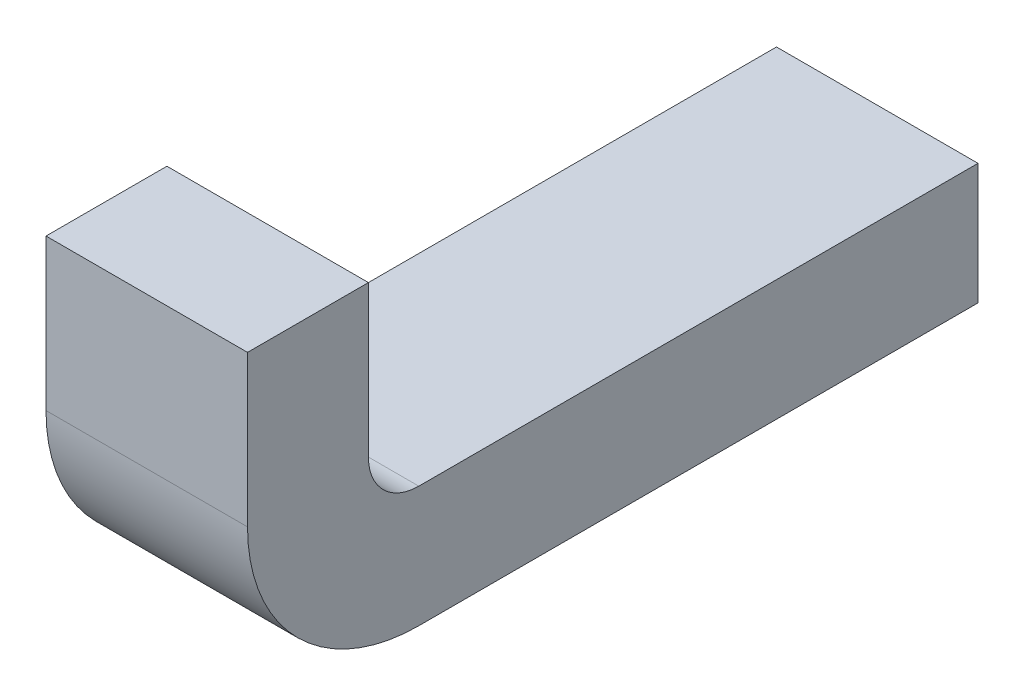
ISO-10303-21;
HEADER;
FILE_DESCRIPTION(('STEP AP214'),'2;1');
FILE_NAME('part.step','',(''),(''),'','','');
FILE_SCHEMA(('AUTOMOTIVE_DESIGN { 1 0 10303 214 1 1 1 1 }'));
ENDSEC;
DATA;
#1=APPLICATION_CONTEXT('core data for automotive mechanical design processes');
#2=APPLICATION_PROTOCOL_DEFINITION('international standard','automotive_design',2000,#1);
#3=PRODUCT_CONTEXT('',#1,'mechanical');
#4=PRODUCT('Part','Part','',(#3));
#5=PRODUCT_RELATED_PRODUCT_CATEGORY('part','',(#4));
#6=PRODUCT_DEFINITION_FORMATION('','',#4);
#7=PRODUCT_DEFINITION_CONTEXT('part definition',#1,'design');
#8=PRODUCT_DEFINITION('design','',#6,#7);
#9=PRODUCT_DEFINITION_SHAPE('','',#8);
#10=(LENGTH_UNIT() NAMED_UNIT(*) SI_UNIT(.MILLI.,.METRE.));
#11=(NAMED_UNIT(*) PLANE_ANGLE_UNIT() SI_UNIT($,.RADIAN.));
#12=(NAMED_UNIT(*) SI_UNIT($,.STERADIAN.) SOLID_ANGLE_UNIT());
#13=UNCERTAINTY_MEASURE_WITH_UNIT(LENGTH_MEASURE(1.E-05),#10,'distance_accuracy_value','');
#14=(GEOMETRIC_REPRESENTATION_CONTEXT(3) GLOBAL_UNCERTAINTY_ASSIGNED_CONTEXT((#13)) GLOBAL_UNIT_ASSIGNED_CONTEXT((#10,
#11,#12)) REPRESENTATION_CONTEXT('',''));
#15=CARTESIAN_POINT('',(0.,0.,0.));
#16=DIRECTION('',(0.,0.,1.));
#17=DIRECTION('',(1.,0.,0.));
#18=AXIS2_PLACEMENT_3D('',#15,#16,#17);
#19=CARTESIAN_POINT('',(-1.35,0.,-3.300000000002));
#20=DIRECTION('',(0.,-1.,0.));
#21=DIRECTION('',(1.,0.,0.));
#22=AXIS2_PLACEMENT_3D('',#19,#20,#21);
#23=PLANE('',#22);
#24=DIRECTION('',(0.,0.,1.));
#25=VECTOR('',#24,1.);
#26=CARTESIAN_POINT('',(-1.35,0.,-3.300000000002));
#27=LINE('',#26,#25);
#28=CARTESIAN_POINT('',(-1.35,0.,-3.300000000002));
#29=VERTEX_POINT('',#28);
#30=CARTESIAN_POINT('',(-1.35,0.,-3.854999999999));
#31=VERTEX_POINT('',#30);
#32=EDGE_CURVE('E121',#29,#31,#27,.F.);
#33=ORIENTED_EDGE('',*,*,#32,.T.);
#34=DIRECTION('',(-1.,0.,0.));
#35=VECTOR('',#34,1.);
#36=CARTESIAN_POINT('',(-1.35,0.,-3.854999999999));
#37=LINE('',#36,#35);
#38=CARTESIAN_POINT('',(-1.15,0.,-3.854999999999));
#39=VERTEX_POINT('',#38);
#40=EDGE_CURVE('E124',#39,#31,#37,.T.);
#41=ORIENTED_EDGE('',*,*,#40,.F.);
#42=DIRECTION('',(0.,0.,1.));
#43=VECTOR('',#42,1.);
#44=CARTESIAN_POINT('',(-1.15,0.,-3.300000000002));
#45=LINE('',#44,#43);
#46=CARTESIAN_POINT('',(-1.15,0.,-3.300000000002));
#47=VERTEX_POINT('',#46);
#48=EDGE_CURVE('E154',#47,#39,#45,.F.);
#49=ORIENTED_EDGE('',*,*,#48,.F.);
#50=DIRECTION('',(1.,0.,0.));
#51=VECTOR('',#50,1.);
#52=CARTESIAN_POINT('',(-1.35,0.,-3.300000000002));
#53=LINE('',#52,#51);
#54=EDGE_CURVE('E63',#29,#47,#53,.T.);
#55=ORIENTED_EDGE('',*,*,#54,.F.);
#56=EDGE_LOOP('',(#33,#41,#49,#55));
#57=FACE_BOUND('',#56,.T.);
#58=ADVANCED_FACE('F16',(#57),#23,.T.);
#59=CARTESIAN_POINT('',(-1.35,0.32,-3.250000000002));
#60=DIRECTION('',(0.,1.,1.246832498358E-13));
#61=DIRECTION('',(0.,-1.246832498358E-13,1.));
#62=AXIS2_PLACEMENT_3D('',#59,#60,#61);
#63=PLANE('',#62);
#64=DIRECTION('',(0.,0.,1.));
#65=VECTOR('',#64,1.);
#66=CARTESIAN_POINT('',(-1.35,0.32,-3.300000000002));
#67=LINE('',#66,#65);
#68=CARTESIAN_POINT('',(-1.35,0.32,-3.250000000002));
#69=VERTEX_POINT('',#68);
#70=CARTESIAN_POINT('',(-1.35,0.32,-3.130000000002));
#71=VERTEX_POINT('',#70);
#72=EDGE_CURVE('E100',#69,#71,#67,.T.);
#73=ORIENTED_EDGE('',*,*,#72,.T.);
#74=DIRECTION('',(1.,0.,0.));
#75=VECTOR('',#74,1.);
#76=CARTESIAN_POINT('',(-1.35,0.32,-3.130000000002));
#77=LINE('',#76,#75);
#78=CARTESIAN_POINT('',(-1.15,0.32,-3.130000000002));
#79=VERTEX_POINT('',#78);
#80=EDGE_CURVE('E162',#79,#71,#77,.F.);
#81=ORIENTED_EDGE('',*,*,#80,.F.);
#82=DIRECTION('',(0.,0.,1.));
#83=VECTOR('',#82,1.);
#84=CARTESIAN_POINT('',(-1.15,0.32,-3.300000000002));
#85=LINE('',#84,#83);
#86=CARTESIAN_POINT('',(-1.15,0.32,-3.250000000002));
#87=VERTEX_POINT('',#86);
#88=EDGE_CURVE('E150',#87,#79,#85,.T.);
#89=ORIENTED_EDGE('',*,*,#88,.F.);
#90=DIRECTION('',(-1.,0.,0.));
#91=VECTOR('',#90,1.);
#92=CARTESIAN_POINT('',(-1.35,0.32,-3.250000000002));
#93=LINE('',#92,#91);
#94=EDGE_CURVE('E72',#69,#87,#93,.F.);
#95=ORIENTED_EDGE('',*,*,#94,.F.);
#96=EDGE_LOOP('',(#73,#81,#89,#95));
#97=FACE_BOUND('',#96,.T.);
#98=ADVANCED_FACE('F182',(#97),#63,.T.);
#99=CARTESIAN_POINT('',(-1.35,0.32,-3.130000000002));
#100=DIRECTION('',(0.,0.,1.));
#101=DIRECTION('',(1.,0.,0.));
#102=AXIS2_PLACEMENT_3D('',#99,#100,#101);
#103=PLANE('',#102);
#104=DIRECTION('',(0.,1.,0.));
#105=VECTOR('',#104,1.);
#106=CARTESIAN_POINT('',(-1.35,0.17,-3.130000000002));
#107=LINE('',#106,#105);
#108=CARTESIAN_POINT('',(-1.35,0.17,-3.130000000002));
#109=VERTEX_POINT('',#108);
#110=EDGE_CURVE('E110',#71,#109,#107,.F.);
#111=ORIENTED_EDGE('',*,*,#110,.T.);
#112=DIRECTION('',(1.,0.,0.));
#113=VECTOR('',#112,1.);
#114=CARTESIAN_POINT('',(-1.35,0.17,-3.130000000002));
#115=LINE('',#114,#113);
#116=CARTESIAN_POINT('',(-1.15,0.17,-3.130000000002));
#117=VERTEX_POINT('',#116);
#118=EDGE_CURVE('E57',#117,#109,#115,.F.);
#119=ORIENTED_EDGE('',*,*,#118,.F.);
#120=DIRECTION('',(0.,1.,0.));
#121=VECTOR('',#120,1.);
#122=CARTESIAN_POINT('',(-1.15,0.17,-3.130000000002));
#123=LINE('',#122,#121);
#124=EDGE_CURVE('E141',#79,#117,#123,.F.);
#125=ORIENTED_EDGE('',*,*,#124,.F.);
#126=ORIENTED_EDGE('',*,*,#80,.T.);
#127=EDGE_LOOP('',(#111,#119,#125,#126));
#128=FACE_BOUND('',#127,.T.);
#129=ADVANCED_FACE('F183',(#128),#103,.T.);
#130=CARTESIAN_POINT('',(-1.35,0.17,-3.300000000002));
#131=DIRECTION('',(1.,0.,0.));
#132=DIRECTION('',(0.,1.,0.));
#133=AXIS2_PLACEMENT_3D('',#130,#131,#132);
#134=CYLINDRICAL_SURFACE('',#133,0.17);
#135=CARTESIAN_POINT('',(-1.35,0.17,-3.300000000002));
#136=DIRECTION('',(1.,0.,0.));
#137=DIRECTION('',(0.,1.,0.));
#138=AXIS2_PLACEMENT_3D('',#135,#136,#137);
#139=CIRCLE('',#138,0.17);
#140=EDGE_CURVE('E96',#109,#29,#139,.T.);
#141=ORIENTED_EDGE('',*,*,#140,.T.);
#142=ORIENTED_EDGE('',*,*,#54,.T.);
#143=CARTESIAN_POINT('',(-1.15,0.17,-3.300000000002));
#144=DIRECTION('',(1.,0.,0.));
#145=DIRECTION('',(0.,1.,0.));
#146=AXIS2_PLACEMENT_3D('',#143,#144,#145);
#147=CIRCLE('',#146,0.17);
#148=EDGE_CURVE('E19',#117,#47,#147,.T.);
#149=ORIENTED_EDGE('',*,*,#148,.F.);
#150=ORIENTED_EDGE('',*,*,#118,.T.);
#151=EDGE_LOOP('',(#141,#142,#149,#150));
#152=FACE_BOUND('',#151,.T.);
#153=ADVANCED_FACE('F185',(#152),#134,.T.);
#154=CARTESIAN_POINT('',(-1.35,0.17,-3.250000000002));
#155=DIRECTION('',(0.,0.,-1.));
#156=DIRECTION('',(-1.,0.,0.));
#157=AXIS2_PLACEMENT_3D('',#154,#155,#156);
#158=PLANE('',#157);
#159=DIRECTION('',(0.,1.,0.));
#160=VECTOR('',#159,1.);
#161=CARTESIAN_POINT('',(-1.35,0.17,-3.250000000002));
#162=LINE('',#161,#160);
#163=CARTESIAN_POINT('',(-1.35,0.17,-3.250000000002));
#164=VERTEX_POINT('',#163);
#165=EDGE_CURVE('E92',#164,#69,#162,.T.);
#166=ORIENTED_EDGE('',*,*,#165,.T.);
#167=ORIENTED_EDGE('',*,*,#94,.T.);
#168=DIRECTION('',(0.,1.,0.));
#169=VECTOR('',#168,1.);
#170=CARTESIAN_POINT('',(-1.15,0.17,-3.250000000002));
#171=LINE('',#170,#169);
#172=CARTESIAN_POINT('',(-1.15,0.17,-3.250000000002));
#173=VERTEX_POINT('',#172);
#174=EDGE_CURVE('E87',#173,#87,#171,.T.);
#175=ORIENTED_EDGE('',*,*,#174,.F.);
#176=DIRECTION('',(1.,0.,0.));
#177=VECTOR('',#176,1.);
#178=CARTESIAN_POINT('',(-1.35,0.17,-3.250000000002));
#179=LINE('',#178,#177);
#180=EDGE_CURVE('E90',#173,#164,#179,.F.);
#181=ORIENTED_EDGE('',*,*,#180,.T.);
#182=EDGE_LOOP('',(#166,#167,#175,#181));
#183=FACE_BOUND('',#182,.T.);
#184=ADVANCED_FACE('F91',(#183),#158,.T.);
#185=CARTESIAN_POINT('',(-1.15,0.17,-3.300000000002));
#186=DIRECTION('',(1.,0.,0.));
#187=DIRECTION('',(0.,1.,0.));
#188=AXIS2_PLACEMENT_3D('',#185,#186,#187);
#189=PLANE('',#188);
#190=ORIENTED_EDGE('',*,*,#88,.T.);
#191=ORIENTED_EDGE('',*,*,#124,.T.);
#192=ORIENTED_EDGE('',*,*,#148,.T.);
#193=ORIENTED_EDGE('',*,*,#48,.T.);
#194=DIRECTION('',(0.,1.,0.));
#195=VECTOR('',#194,1.);
#196=CARTESIAN_POINT('',(-1.15,0.,-3.854999999999));
#197=LINE('',#196,#195);
#198=CARTESIAN_POINT('',(-1.15,0.12,-3.854999999999));
#199=VERTEX_POINT('',#198);
#200=EDGE_CURVE('E138',#199,#39,#197,.F.);
#201=ORIENTED_EDGE('',*,*,#200,.F.);
#202=DIRECTION('',(0.,0.,1.));
#203=VECTOR('',#202,1.);
#204=CARTESIAN_POINT('',(-1.15,0.12,-3.854999999999));
#205=LINE('',#204,#203);
#206=CARTESIAN_POINT('',(-1.15,0.119999999999999,-3.300000000002));
#207=VERTEX_POINT('',#206);
#208=EDGE_CURVE('E107',#207,#199,#205,.F.);
#209=ORIENTED_EDGE('',*,*,#208,.F.);
#210=CARTESIAN_POINT('',(-1.15,0.17,-3.300000000002));
#211=DIRECTION('',(1.,0.,0.));
#212=DIRECTION('',(0.,1.,0.));
#213=AXIS2_PLACEMENT_3D('',#210,#211,#212);
#214=CIRCLE('',#213,0.05);
#215=EDGE_CURVE('E105',#207,#173,#214,.F.);
#216=ORIENTED_EDGE('',*,*,#215,.T.);
#217=ORIENTED_EDGE('',*,*,#174,.T.);
#218=EDGE_LOOP('',(#190,#191,#192,#193,#201,#209,#216,#217));
#219=FACE_BOUND('',#218,.T.);
#220=ADVANCED_FACE('F179',(#219),#189,.T.);
#221=CARTESIAN_POINT('',(-1.35,0.,-3.854999999999));
#222=DIRECTION('',(0.,0.,-1.));
#223=DIRECTION('',(-1.,0.,0.));
#224=AXIS2_PLACEMENT_3D('',#221,#222,#223);
#225=PLANE('',#224);
#226=DIRECTION('',(0.,1.,0.));
#227=VECTOR('',#226,1.);
#228=CARTESIAN_POINT('',(-1.35,0.17,-3.854999999999));
#229=LINE('',#228,#227);
#230=CARTESIAN_POINT('',(-1.35,0.12,-3.854999999999));
#231=VERTEX_POINT('',#230);
#232=EDGE_CURVE('E101',#31,#231,#229,.T.);
#233=ORIENTED_EDGE('',*,*,#232,.T.);
#234=DIRECTION('',(-1.,0.,0.));
#235=VECTOR('',#234,1.);
#236=CARTESIAN_POINT('',(-1.35,0.12,-3.854999999999));
#237=LINE('',#236,#235);
#238=EDGE_CURVE('E128',#199,#231,#237,.T.);
#239=ORIENTED_EDGE('',*,*,#238,.F.);
#240=ORIENTED_EDGE('',*,*,#200,.T.);
#241=ORIENTED_EDGE('',*,*,#40,.T.);
#242=EDGE_LOOP('',(#233,#239,#240,#241));
#243=FACE_BOUND('',#242,.T.);
#244=ADVANCED_FACE('F204',(#243),#225,.T.);
#245=CARTESIAN_POINT('',(-1.35,0.17,-3.300000000002));
#246=DIRECTION('',(1.,0.,0.));
#247=DIRECTION('',(0.,1.,0.));
#248=AXIS2_PLACEMENT_3D('',#245,#246,#247);
#249=PLANE('',#248);
#250=ORIENTED_EDGE('',*,*,#110,.F.);
#251=ORIENTED_EDGE('',*,*,#72,.F.);
#252=ORIENTED_EDGE('',*,*,#165,.F.);
#253=CARTESIAN_POINT('',(-1.35,0.17,-3.300000000002));
#254=DIRECTION('',(1.,0.,0.));
#255=DIRECTION('',(0.,1.,0.));
#256=AXIS2_PLACEMENT_3D('',#253,#254,#255);
#257=CIRCLE('',#256,0.05);
#258=CARTESIAN_POINT('',(-1.35,0.12,-3.300000000002));
#259=VERTEX_POINT('',#258);
#260=EDGE_CURVE('E34',#164,#259,#257,.T.);
#261=ORIENTED_EDGE('',*,*,#260,.T.);
#262=DIRECTION('',(0.,0.,1.));
#263=VECTOR('',#262,1.);
#264=CARTESIAN_POINT('',(-1.35,0.12,-3.854999999999));
#265=LINE('',#264,#263);
#266=EDGE_CURVE('E25',#231,#259,#265,.T.);
#267=ORIENTED_EDGE('',*,*,#266,.F.);
#268=ORIENTED_EDGE('',*,*,#232,.F.);
#269=ORIENTED_EDGE('',*,*,#32,.F.);
#270=ORIENTED_EDGE('',*,*,#140,.F.);
#271=EDGE_LOOP('',(#250,#251,#252,#261,#267,#268,#269,#270));
#272=FACE_BOUND('',#271,.T.);
#273=ADVANCED_FACE('F99',(#272),#249,.F.);
#274=CARTESIAN_POINT('',(-1.35,0.17,-3.300000000002));
#275=DIRECTION('',(1.,0.,0.));
#276=DIRECTION('',(0.,1.,0.));
#277=AXIS2_PLACEMENT_3D('',#274,#275,#276);
#278=CYLINDRICAL_SURFACE('',#277,0.05);
#279=DIRECTION('',(-1.,0.,0.));
#280=VECTOR('',#279,1.);
#281=CARTESIAN_POINT('',(-1.35,0.12,-3.300000000002));
#282=LINE('',#281,#280);
#283=EDGE_CURVE('E11',#259,#207,#282,.F.);
#284=ORIENTED_EDGE('',*,*,#283,.F.);
#285=ORIENTED_EDGE('',*,*,#260,.F.);
#286=ORIENTED_EDGE('',*,*,#180,.F.);
#287=ORIENTED_EDGE('',*,*,#215,.F.);
#288=EDGE_LOOP('',(#284,#285,#286,#287));
#289=FACE_BOUND('',#288,.T.);
#290=ADVANCED_FACE('F103',(#289),#278,.F.);
#291=CARTESIAN_POINT('',(-1.35,0.12,-3.854999999999));
#292=DIRECTION('',(0.,1.,0.));
#293=DIRECTION('',(-1.,0.,0.));
#294=AXIS2_PLACEMENT_3D('',#291,#292,#293);
#295=PLANE('',#294);
#296=ORIENTED_EDGE('',*,*,#266,.T.);
#297=ORIENTED_EDGE('',*,*,#283,.T.);
#298=ORIENTED_EDGE('',*,*,#208,.T.);
#299=ORIENTED_EDGE('',*,*,#238,.T.);
#300=EDGE_LOOP('',(#296,#297,#298,#299));
#301=FACE_BOUND('',#300,.T.);
#302=ADVANCED_FACE('F193',(#301),#295,.T.);
#303=CLOSED_SHELL('',(#58,#98,#129,#153,#184,#220,#244,#273,#290,#302));
#304=MANIFOLD_SOLID_BREP('B1',#303);
#305=ADVANCED_BREP_SHAPE_REPRESENTATION('',(#18,#304),#14);
#306=SHAPE_DEFINITION_REPRESENTATION(#9,#305);
ENDSEC;
END-ISO-10303-21;
